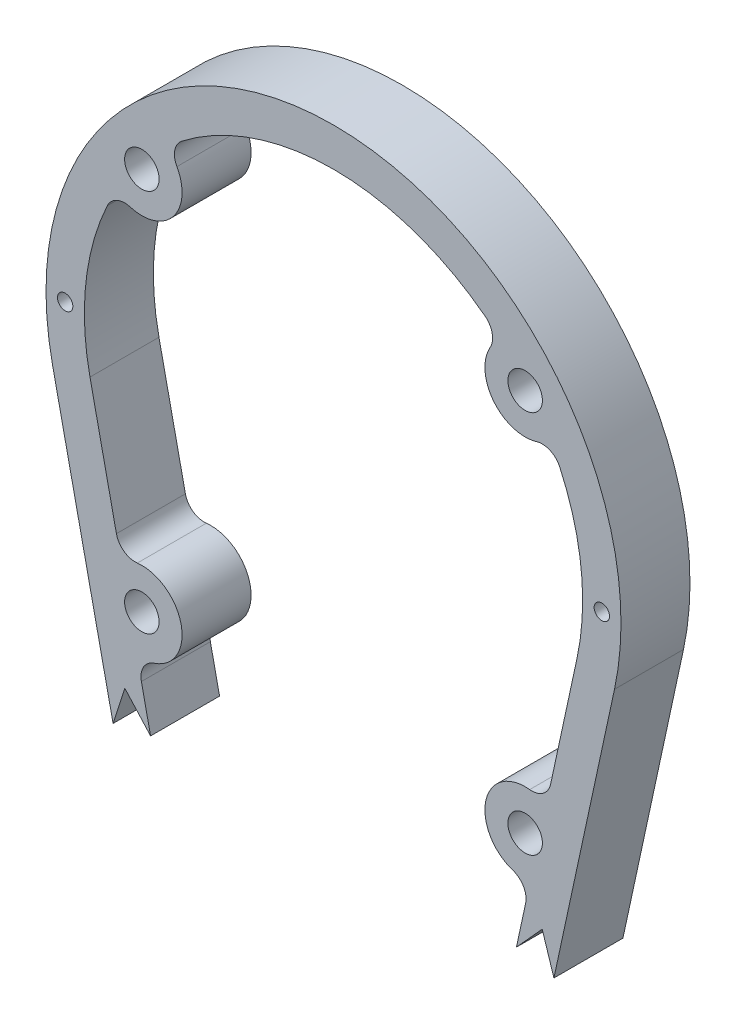
ISO-10303-21;
HEADER;
FILE_DESCRIPTION(('STEP AP214'),'2;1');
FILE_NAME('part.step','',(''),(''),'','','');
FILE_SCHEMA(('AUTOMOTIVE_DESIGN { 1 0 10303 214 1 1 1 1 }'));
ENDSEC;
DATA;
#1=APPLICATION_CONTEXT('core data for automotive mechanical design processes');
#2=APPLICATION_PROTOCOL_DEFINITION('international standard','automotive_design',2000,#1);
#3=PRODUCT_CONTEXT('',#1,'mechanical');
#4=PRODUCT('Part','Part','',(#3));
#5=PRODUCT_RELATED_PRODUCT_CATEGORY('part','',(#4));
#6=PRODUCT_DEFINITION_FORMATION('','',#4);
#7=PRODUCT_DEFINITION_CONTEXT('part definition',#1,'design');
#8=PRODUCT_DEFINITION('design','',#6,#7);
#9=PRODUCT_DEFINITION_SHAPE('','',#8);
#10=(LENGTH_UNIT() NAMED_UNIT(*) SI_UNIT(.MILLI.,.METRE.));
#11=(NAMED_UNIT(*) PLANE_ANGLE_UNIT() SI_UNIT($,.RADIAN.));
#12=(NAMED_UNIT(*) SI_UNIT($,.STERADIAN.) SOLID_ANGLE_UNIT());
#13=UNCERTAINTY_MEASURE_WITH_UNIT(LENGTH_MEASURE(1.E-05),#10,'distance_accuracy_value','');
#14=(GEOMETRIC_REPRESENTATION_CONTEXT(3) GLOBAL_UNCERTAINTY_ASSIGNED_CONTEXT((#13)) GLOBAL_UNIT_ASSIGNED_CONTEXT((#10,
#11,#12)) REPRESENTATION_CONTEXT('',''));
#15=CARTESIAN_POINT('',(0.,0.,0.));
#16=DIRECTION('',(0.,0.,1.));
#17=DIRECTION('',(1.,0.,0.));
#18=AXIS2_PLACEMENT_3D('',#15,#16,#17);
#19=CARTESIAN_POINT('',(-31.9298733487398,-112.5,18.));
#20=DIRECTION('',(0.,0.,1.));
#21=DIRECTION('',(1.,0.,0.));
#22=AXIS2_PLACEMENT_3D('',#19,#20,#21);
#23=PLANE('',#22);
#24=CARTESIAN_POINT('',(70.,47.5,18.));
#25=DIRECTION('',(0.,0.,1.));
#26=DIRECTION('',(1.,0.,0.));
#27=AXIS2_PLACEMENT_3D('',#24,#25,#26);
#28=CIRCLE('',#27,2.);
#29=CARTESIAN_POINT('',(72.,47.5,18.));
#30=VERTEX_POINT('',#29);
#31=EDGE_CURVE('E557',#30,#30,#28,.T.);
#32=ORIENTED_EDGE('',*,*,#31,.F.);
#33=EDGE_LOOP('',(#32));
#34=FACE_BOUND('',#33,.T.);
#35=CARTESIAN_POINT('',(-70.,47.5,18.));
#36=DIRECTION('',(0.,0.,1.));
#37=DIRECTION('',(1.,0.,0.));
#38=AXIS2_PLACEMENT_3D('',#35,#36,#37);
#39=CIRCLE('',#38,2.);
#40=CARTESIAN_POINT('',(-68.,47.5,18.));
#41=VERTEX_POINT('',#40);
#42=EDGE_CURVE('E551',#41,#41,#39,.T.);
#43=ORIENTED_EDGE('',*,*,#42,.F.);
#44=EDGE_LOOP('',(#43));
#45=FACE_BOUND('',#44,.T.);
#46=DIRECTION('',(-0.306753150837407,-0.95178910713,0.));
#47=VECTOR('',#46,1.);
#48=CARTESIAN_POINT('',(-57.5063561450649,-41.4755483598365,18.));
#49=LINE('',#48,#47);
#50=CARTESIAN_POINT('',(-54.4439824625953,-31.9736609139237,18.));
#51=VERTEX_POINT('',#50);
#52=CARTESIAN_POINT('',(-57.5063561450649,-41.4755483598365,18.));
#53=VERTEX_POINT('',#52);
#54=EDGE_CURVE('E217',#51,#53,#49,.T.);
#55=ORIENTED_EDGE('',*,*,#54,.F.);
#56=DIRECTION('',(-0.67089697040122,0.741550574881083,0.));
#57=VECTOR('',#56,1.);
#58=CARTESIAN_POINT('',(-54.4439824625953,-31.9736609139237,18.));
#59=LINE('',#58,#57);
#60=CARTESIAN_POINT('',(-47.7236876934698,-39.4016843948391,18.));
#61=VERTEX_POINT('',#60);
#62=EDGE_CURVE('E542',#61,#51,#59,.T.);
#63=ORIENTED_EDGE('',*,*,#62,.F.);
#64=DIRECTION('',(0.211189373172623,-0.977445164016353,0.));
#65=VECTOR('',#64,1.);
#66=CARTESIAN_POINT('',(-31.9298733487398,-112.5,18.));
#67=LINE('',#66,#65);
#68=CARTESIAN_POINT('',(-50.1212592306133,-28.3050337009208,18.));
#69=VERTEX_POINT('',#68);
#70=EDGE_CURVE('E363',#69,#61,#67,.T.);
#71=ORIENTED_EDGE('',*,*,#70,.F.);
#72=CARTESIAN_POINT('',(-45.2340334105316,-27.2490868350576,18.));
#73=DIRECTION('',(0.,0.,1.));
#74=DIRECTION('',(1.,0.,0.));
#75=AXIS2_PLACEMENT_3D('',#72,#73,#74);
#76=CIRCLE('',#75,5.);
#77=CARTESIAN_POINT('',(-46.7714419877795,-22.4913168882649,18.));
#78=VERTEX_POINT('',#77);
#79=EDGE_CURVE('E305',#69,#78,#76,.F.);
#80=ORIENTED_EDGE('',*,*,#79,.T.);
#81=CARTESIAN_POINT('',(-50.,-12.5,18.));
#82=DIRECTION('',(0.,0.,-1.));
#83=DIRECTION('',(1.,0.,0.));
#84=AXIS2_PLACEMENT_3D('',#81,#82,#83);
#85=CIRCLE('',#84,10.5);
#86=CARTESIAN_POINT('',(-51.1843712947804,-2.06701075261266,18.));
#87=VERTEX_POINT('',#86);
#88=EDGE_CURVE('E360',#87,#78,#85,.T.);
#89=ORIENTED_EDGE('',*,*,#88,.F.);
#90=CARTESIAN_POINT('',(-51.7483576256283,2.90107936519085,18.));
#91=DIRECTION('',(0.,0.,1.));
#92=DIRECTION('',(1.,0.,0.));
#93=AXIS2_PLACEMENT_3D('',#90,#91,#92);
#94=CIRCLE('',#93,5.);
#95=CARTESIAN_POINT('',(-56.63558344571,1.84513249932773,18.));
#96=VERTEX_POINT('',#95);
#97=EDGE_CURVE('E292',#87,#96,#94,.F.);
#98=ORIENTED_EDGE('',*,*,#97,.T.);
#99=DIRECTION('',(0.211189373172623,-0.977445164016353,0.));
#100=VECTOR('',#99,1.);
#101=CARTESIAN_POINT('',(-55.4723236772757,-3.53876830055558,18.));
#102=LINE('',#101,#100);
#103=CARTESIAN_POINT('',(-63.5339356610629,33.7726907437795,18.));
#104=VERTEX_POINT('',#103);
#105=EDGE_CURVE('E351',#104,#96,#102,.T.);
#106=ORIENTED_EDGE('',*,*,#105,.F.);
#107=CARTESIAN_POINT('',(0.,47.5,18.));
#108=DIRECTION('',(0.,0.,1.));
#109=DIRECTION('',(1.,0.,0.));
#110=AXIS2_PLACEMENT_3D('',#107,#108,#109);
#111=CIRCLE('',#110,65.);
#112=CARTESIAN_POINT('',(-59.0097536999229,74.755255791763,18.));
#113=VERTEX_POINT('',#112);
#114=EDGE_CURVE('E345',#113,#104,#111,.T.);
#115=ORIENTED_EDGE('',*,*,#114,.F.);
#116=CARTESIAN_POINT('',(-54.4705418768519,72.6586976539351,18.));
#117=DIRECTION('',(0.,0.,1.));
#118=DIRECTION('',(1.,0.,0.));
#119=AXIS2_PLACEMENT_3D('',#116,#117,#118);
#120=CIRCLE('',#119,5.);
#121=CARTESIAN_POINT('',(-53.0284315939965,77.4462145397625,18.));
#122=VERTEX_POINT('',#121);
#123=EDGE_CURVE('E11',#113,#122,#120,.F.);
#124=ORIENTED_EDGE('',*,*,#123,.T.);
#125=CARTESIAN_POINT('',(-50.,87.5,18.));
#126=DIRECTION('',(0.,0.,-1.));
#127=DIRECTION('',(1.,0.,0.));
#128=AXIS2_PLACEMENT_3D('',#125,#126,#127);
#129=CIRCLE('',#128,10.5);
#130=CARTESIAN_POINT('',(-40.8562064862553,92.661495924439,18.));
#131=VERTEX_POINT('',#130);
#132=EDGE_CURVE('E342',#131,#122,#129,.T.);
#133=ORIENTED_EDGE('',*,*,#132,.F.);
#134=CARTESIAN_POINT('',(-36.5020190987578,95.1193511265528,18.));
#135=DIRECTION('',(0.,0.,1.));
#136=DIRECTION('',(1.,0.,0.));
#137=AXIS2_PLACEMENT_3D('',#134,#135,#136);
#138=CIRCLE('',#137,5.);
#139=CARTESIAN_POINT('',(-39.5438540236543,99.0876303870988,18.));
#140=VERTEX_POINT('',#139);
#141=EDGE_CURVE('E317',#131,#140,#138,.F.);
#142=ORIENTED_EDGE('',*,*,#141,.T.);
#143=CARTESIAN_POINT('',(0.,47.5,18.));
#144=DIRECTION('',(0.,0.,1.));
#145=DIRECTION('',(1.,0.,0.));
#146=AXIS2_PLACEMENT_3D('',#143,#144,#145);
#147=CIRCLE('',#146,65.);
#148=CARTESIAN_POINT('',(39.5438540236543,99.0876303870988,18.));
#149=VERTEX_POINT('',#148);
#150=EDGE_CURVE('E349',#149,#140,#147,.T.);
#151=ORIENTED_EDGE('',*,*,#150,.F.);
#152=CARTESIAN_POINT('',(36.5020190987578,95.1193511265527,18.));
#153=DIRECTION('',(0.,0.,1.));
#154=DIRECTION('',(1.,0.,0.));
#155=AXIS2_PLACEMENT_3D('',#152,#153,#154);
#156=CIRCLE('',#155,5.);
#157=CARTESIAN_POINT('',(40.8562064862553,92.6614959244389,18.));
#158=VERTEX_POINT('',#157);
#159=EDGE_CURVE('E313',#149,#158,#156,.F.);
#160=ORIENTED_EDGE('',*,*,#159,.T.);
#161=CARTESIAN_POINT('',(50.,87.5,18.));
#162=DIRECTION('',(0.,0.,-1.));
#163=DIRECTION('',(1.,0.,0.));
#164=AXIS2_PLACEMENT_3D('',#161,#162,#163);
#165=CIRCLE('',#164,10.5);
#166=CARTESIAN_POINT('',(53.0284315939965,77.4462145397625,18.));
#167=VERTEX_POINT('',#166);
#168=EDGE_CURVE('E354',#167,#158,#165,.T.);
#169=ORIENTED_EDGE('',*,*,#168,.F.);
#170=CARTESIAN_POINT('',(54.470541876852,72.6586976539351,18.));
#171=DIRECTION('',(0.,0.,1.));
#172=DIRECTION('',(1.,0.,0.));
#173=AXIS2_PLACEMENT_3D('',#170,#171,#172);
#174=CIRCLE('',#173,5.);
#175=CARTESIAN_POINT('',(59.009753699923,74.755255791763,18.));
#176=VERTEX_POINT('',#175);
#177=EDGE_CURVE('E309',#167,#176,#174,.F.);
#178=ORIENTED_EDGE('',*,*,#177,.T.);
#179=CARTESIAN_POINT('',(0.,47.5,18.));
#180=DIRECTION('',(0.,0.,1.));
#181=DIRECTION('',(1.,0.,0.));
#182=AXIS2_PLACEMENT_3D('',#179,#180,#181);
#183=CIRCLE('',#182,65.);
#184=CARTESIAN_POINT('',(63.5339356610629,33.7726907437795,18.));
#185=VERTEX_POINT('',#184);
#186=EDGE_CURVE('E445',#185,#176,#183,.T.);
#187=ORIENTED_EDGE('',*,*,#186,.F.);
#188=DIRECTION('',(0.211189373172623,0.977445164016353,0.));
#189=VECTOR('',#188,1.);
#190=CARTESIAN_POINT('',(55.4723236772757,-3.53876830055554,18.));
#191=LINE('',#190,#189);
#192=CARTESIAN_POINT('',(56.63558344571,1.84513249932773,18.));
#193=VERTEX_POINT('',#192);
#194=EDGE_CURVE('E443',#193,#185,#191,.T.);
#195=ORIENTED_EDGE('',*,*,#194,.F.);
#196=CARTESIAN_POINT('',(51.7483576256282,2.90107936519085,18.));
#197=DIRECTION('',(0.,0.,1.));
#198=DIRECTION('',(1.,0.,0.));
#199=AXIS2_PLACEMENT_3D('',#196,#197,#198);
#200=CIRCLE('',#199,5.);
#201=CARTESIAN_POINT('',(51.1843712947804,-2.06701075261265,18.));
#202=VERTEX_POINT('',#201);
#203=EDGE_CURVE('E296',#193,#202,#200,.F.);
#204=ORIENTED_EDGE('',*,*,#203,.T.);
#205=CARTESIAN_POINT('',(50.,-12.5,18.));
#206=DIRECTION('',(0.,0.,-1.));
#207=DIRECTION('',(1.,0.,0.));
#208=AXIS2_PLACEMENT_3D('',#205,#206,#207);
#209=CIRCLE('',#208,10.5);
#210=CARTESIAN_POINT('',(46.7714419877795,-22.4913168882648,18.));
#211=VERTEX_POINT('',#210);
#212=EDGE_CURVE('E393',#211,#202,#209,.T.);
#213=ORIENTED_EDGE('',*,*,#212,.F.);
#214=CARTESIAN_POINT('',(45.2340334105316,-27.2490868350576,18.));
#215=DIRECTION('',(0.,0.,1.));
#216=DIRECTION('',(1.,0.,0.));
#217=AXIS2_PLACEMENT_3D('',#214,#215,#216);
#218=CIRCLE('',#217,5.);
#219=CARTESIAN_POINT('',(50.1212592306133,-28.3050337009207,18.));
#220=VERTEX_POINT('',#219);
#221=EDGE_CURVE('E300',#211,#220,#218,.F.);
#222=ORIENTED_EDGE('',*,*,#221,.T.);
#223=DIRECTION('',(0.211189373172623,0.977445164016353,0.));
#224=VECTOR('',#223,1.);
#225=CARTESIAN_POINT('',(31.9298733487398,-112.5,18.));
#226=LINE('',#225,#224);
#227=CARTESIAN_POINT('',(47.7244032118376,-39.3983727700264,18.));
#228=VERTEX_POINT('',#227);
#229=EDGE_CURVE('E366',#228,#220,#226,.T.);
#230=ORIENTED_EDGE('',*,*,#229,.F.);
#231=DIRECTION('',(-0.670959777554308,-0.741493747043273,0.));
#232=VECTOR('',#231,1.);
#233=CARTESIAN_POINT('',(47.7244032118376,-39.3983727700264,18.));
#234=LINE('',#233,#232);
#235=CARTESIAN_POINT('',(54.4443390688109,-31.9720104377862,18.));
#236=VERTEX_POINT('',#235);
#237=EDGE_CURVE('E57',#236,#228,#234,.T.);
#238=ORIENTED_EDGE('',*,*,#237,.F.);
#239=DIRECTION('',(-0.306672532909785,0.951815085801174,0.));
#240=VECTOR('',#239,1.);
#241=CARTESIAN_POINT('',(54.4443390688109,-31.9720104377862,18.));
#242=LINE('',#241,#240);
#243=CARTESIAN_POINT('',(57.5063561450649,-41.4755483598365,18.));
#244=VERTEX_POINT('',#243);
#245=EDGE_CURVE('E541',#244,#236,#242,.T.);
#246=ORIENTED_EDGE('',*,*,#245,.F.);
#247=DIRECTION('',(0.211189373172623,0.977445164016353,0.));
#248=VECTOR('',#247,1.);
#249=CARTESIAN_POINT('',(41.7043249889033,-114.611893731726,18.));
#250=LINE('',#249,#248);
#251=CARTESIAN_POINT('',(73.3083873012265,31.6607970120533,18.));
#252=VERTEX_POINT('',#251);
#253=EDGE_CURVE('E225',#244,#252,#250,.T.);
#254=ORIENTED_EDGE('',*,*,#253,.T.);
#255=CARTESIAN_POINT('',(0.,47.5,18.));
#256=DIRECTION('',(0.,0.,1.));
#257=DIRECTION('',(1.,0.,0.));
#258=AXIS2_PLACEMENT_3D('',#255,#256,#257);
#259=CIRCLE('',#258,75.);
#260=CARTESIAN_POINT('',(-73.3083873012264,31.6607970120533,18.));
#261=VERTEX_POINT('',#260);
#262=EDGE_CURVE('E418',#252,#261,#259,.T.);
#263=ORIENTED_EDGE('',*,*,#262,.T.);
#264=DIRECTION('',(0.211189373172623,-0.977445164016353,0.));
#265=VECTOR('',#264,1.);
#266=CARTESIAN_POINT('',(-73.3083873012264,31.6607970120533,18.));
#267=LINE('',#266,#265);
#268=EDGE_CURVE('E240',#261,#53,#267,.T.);
#269=ORIENTED_EDGE('',*,*,#268,.T.);
#270=EDGE_LOOP('',(#55,#63,#71,#80,#89,#98,#106,#115,#124,#133,#142,#151,#160,#169,#178,#187,
#195,#204,#213,#222,#230,#238,#246,#254,#263,#269));
#271=FACE_BOUND('',#270,.T.);
#272=CARTESIAN_POINT('',(-50.,87.5,18.));
#273=DIRECTION('',(0.,0.,1.));
#274=DIRECTION('',(1.,0.,0.));
#275=AXIS2_PLACEMENT_3D('',#272,#273,#274);
#276=CIRCLE('',#275,4.5);
#277=CARTESIAN_POINT('',(-45.5,87.5,18.));
#278=VERTEX_POINT('',#277);
#279=EDGE_CURVE('E405',#278,#278,#276,.T.);
#280=ORIENTED_EDGE('',*,*,#279,.F.);
#281=EDGE_LOOP('',(#280));
#282=FACE_BOUND('',#281,.T.);
#283=CARTESIAN_POINT('',(50.,-12.5,18.));
#284=DIRECTION('',(0.,0.,1.));
#285=DIRECTION('',(1.,0.,0.));
#286=AXIS2_PLACEMENT_3D('',#283,#284,#285);
#287=CIRCLE('',#286,4.5);
#288=CARTESIAN_POINT('',(54.5,-12.5,18.));
#289=VERTEX_POINT('',#288);
#290=EDGE_CURVE('E232',#289,#289,#287,.T.);
#291=ORIENTED_EDGE('',*,*,#290,.F.);
#292=EDGE_LOOP('',(#291));
#293=FACE_BOUND('',#292,.T.);
#294=CARTESIAN_POINT('',(50.,87.5,18.));
#295=DIRECTION('',(0.,0.,1.));
#296=DIRECTION('',(1.,0.,0.));
#297=AXIS2_PLACEMENT_3D('',#294,#295,#296);
#298=CIRCLE('',#297,4.5);
#299=CARTESIAN_POINT('',(54.5,87.5,18.));
#300=VERTEX_POINT('',#299);
#301=EDGE_CURVE('E411',#300,#300,#298,.T.);
#302=ORIENTED_EDGE('',*,*,#301,.F.);
#303=EDGE_LOOP('',(#302));
#304=FACE_BOUND('',#303,.T.);
#305=CARTESIAN_POINT('',(-50.,-12.5,18.));
#306=DIRECTION('',(0.,0.,1.));
#307=DIRECTION('',(1.,0.,0.));
#308=AXIS2_PLACEMENT_3D('',#305,#306,#307);
#309=CIRCLE('',#308,4.5);
#310=CARTESIAN_POINT('',(-45.5,-12.5,18.));
#311=VERTEX_POINT('',#310);
#312=EDGE_CURVE('E399',#311,#311,#309,.T.);
#313=ORIENTED_EDGE('',*,*,#312,.F.);
#314=EDGE_LOOP('',(#313));
#315=FACE_BOUND('',#314,.T.);
#316=ADVANCED_FACE('F34',(#34,#45,#271,#282,#293,#304,#315),#23,.T.);
#317=CARTESIAN_POINT('',(-31.9298733487398,-112.5,0.));
#318=DIRECTION('',(0.,0.,1.));
#319=DIRECTION('',(1.,0.,0.));
#320=AXIS2_PLACEMENT_3D('',#317,#318,#319);
#321=PLANE('',#320);
#322=CARTESIAN_POINT('',(70.,47.5,0.));
#323=DIRECTION('',(0.,0.,1.));
#324=DIRECTION('',(1.,0.,0.));
#325=AXIS2_PLACEMENT_3D('',#322,#323,#324);
#326=CIRCLE('',#325,2.);
#327=CARTESIAN_POINT('',(72.,47.5,0.));
#328=VERTEX_POINT('',#327);
#329=EDGE_CURVE('E554',#328,#328,#326,.T.);
#330=ORIENTED_EDGE('',*,*,#329,.T.);
#331=EDGE_LOOP('',(#330));
#332=FACE_BOUND('',#331,.T.);
#333=CARTESIAN_POINT('',(-70.,47.5,0.));
#334=DIRECTION('',(0.,0.,1.));
#335=DIRECTION('',(1.,0.,0.));
#336=AXIS2_PLACEMENT_3D('',#333,#334,#335);
#337=CIRCLE('',#336,2.);
#338=CARTESIAN_POINT('',(-68.,47.5,0.));
#339=VERTEX_POINT('',#338);
#340=EDGE_CURVE('E545',#339,#339,#337,.T.);
#341=ORIENTED_EDGE('',*,*,#340,.T.);
#342=EDGE_LOOP('',(#341));
#343=FACE_BOUND('',#342,.T.);
#344=CARTESIAN_POINT('',(-50.,-12.5,0.));
#345=DIRECTION('',(0.,0.,1.));
#346=DIRECTION('',(1.,0.,0.));
#347=AXIS2_PLACEMENT_3D('',#344,#345,#346);
#348=CIRCLE('',#347,4.5);
#349=CARTESIAN_POINT('',(-45.5,-12.5,0.));
#350=VERTEX_POINT('',#349);
#351=EDGE_CURVE('E398',#350,#350,#348,.T.);
#352=ORIENTED_EDGE('',*,*,#351,.T.);
#353=EDGE_LOOP('',(#352));
#354=FACE_BOUND('',#353,.T.);
#355=CARTESIAN_POINT('',(-50.,87.5,0.));
#356=DIRECTION('',(0.,0.,1.));
#357=DIRECTION('',(1.,0.,0.));
#358=AXIS2_PLACEMENT_3D('',#355,#356,#357);
#359=CIRCLE('',#358,4.5);
#360=CARTESIAN_POINT('',(-45.5,87.5,0.));
#361=VERTEX_POINT('',#360);
#362=EDGE_CURVE('E402',#361,#361,#359,.T.);
#363=ORIENTED_EDGE('',*,*,#362,.T.);
#364=EDGE_LOOP('',(#363));
#365=FACE_BOUND('',#364,.T.);
#366=CARTESIAN_POINT('',(50.,87.5,0.));
#367=DIRECTION('',(0.,0.,1.));
#368=DIRECTION('',(1.,0.,0.));
#369=AXIS2_PLACEMENT_3D('',#366,#367,#368);
#370=CIRCLE('',#369,4.5);
#371=CARTESIAN_POINT('',(54.5,87.5,0.));
#372=VERTEX_POINT('',#371);
#373=EDGE_CURVE('E408',#372,#372,#370,.T.);
#374=ORIENTED_EDGE('',*,*,#373,.T.);
#375=EDGE_LOOP('',(#374));
#376=FACE_BOUND('',#375,.T.);
#377=CARTESIAN_POINT('',(50.,-12.5,0.));
#378=DIRECTION('',(0.,0.,1.));
#379=DIRECTION('',(1.,0.,0.));
#380=AXIS2_PLACEMENT_3D('',#377,#378,#379);
#381=CIRCLE('',#380,4.5);
#382=CARTESIAN_POINT('',(54.5,-12.5,0.));
#383=VERTEX_POINT('',#382);
#384=EDGE_CURVE('E237',#383,#383,#381,.T.);
#385=ORIENTED_EDGE('',*,*,#384,.T.);
#386=EDGE_LOOP('',(#385));
#387=FACE_BOUND('',#386,.T.);
#388=DIRECTION('',(-0.67089697040122,0.741550574881083,0.));
#389=VECTOR('',#388,1.);
#390=CARTESIAN_POINT('',(-54.4439824625953,-31.9736609139237,0.));
#391=LINE('',#390,#389);
#392=CARTESIAN_POINT('',(-47.7236876934698,-39.4016843948391,0.));
#393=VERTEX_POINT('',#392);
#394=CARTESIAN_POINT('',(-54.4439824625953,-31.9736609139237,0.));
#395=VERTEX_POINT('',#394);
#396=EDGE_CURVE('E49',#393,#395,#391,.T.);
#397=ORIENTED_EDGE('',*,*,#396,.T.);
#398=DIRECTION('',(-0.306753150837407,-0.95178910713,0.));
#399=VECTOR('',#398,1.);
#400=CARTESIAN_POINT('',(-57.5063561450649,-41.4755483598365,0.));
#401=LINE('',#400,#399);
#402=CARTESIAN_POINT('',(-57.5063561450649,-41.4755483598365,0.));
#403=VERTEX_POINT('',#402);
#404=EDGE_CURVE('E226',#395,#403,#401,.T.);
#405=ORIENTED_EDGE('',*,*,#404,.T.);
#406=DIRECTION('',(0.211189373172623,-0.977445164016353,0.));
#407=VECTOR('',#406,1.);
#408=CARTESIAN_POINT('',(-73.3083873012264,31.6607970120533,0.));
#409=LINE('',#408,#407);
#410=CARTESIAN_POINT('',(-73.3083873012264,31.6607970120533,0.));
#411=VERTEX_POINT('',#410);
#412=EDGE_CURVE('E234',#411,#403,#409,.T.);
#413=ORIENTED_EDGE('',*,*,#412,.F.);
#414=CARTESIAN_POINT('',(0.,47.5,0.));
#415=DIRECTION('',(0.,0.,1.));
#416=DIRECTION('',(1.,0.,0.));
#417=AXIS2_PLACEMENT_3D('',#414,#415,#416);
#418=CIRCLE('',#417,75.);
#419=CARTESIAN_POINT('',(73.3083873012265,31.6607970120533,0.));
#420=VERTEX_POINT('',#419);
#421=EDGE_CURVE('E231',#420,#411,#418,.T.);
#422=ORIENTED_EDGE('',*,*,#421,.F.);
#423=DIRECTION('',(0.211189373172623,0.977445164016353,0.));
#424=VECTOR('',#423,1.);
#425=CARTESIAN_POINT('',(41.7043249889033,-114.611893731726,0.));
#426=LINE('',#425,#424);
#427=CARTESIAN_POINT('',(57.5063561450649,-41.4755483598365,0.));
#428=VERTEX_POINT('',#427);
#429=EDGE_CURVE('E223',#428,#420,#426,.T.);
#430=ORIENTED_EDGE('',*,*,#429,.F.);
#431=DIRECTION('',(-0.306672532909785,0.951815085801174,0.));
#432=VECTOR('',#431,1.);
#433=CARTESIAN_POINT('',(54.4443390688109,-31.9720104377862,0.));
#434=LINE('',#433,#432);
#435=CARTESIAN_POINT('',(54.4443390688109,-31.9720104377862,0.));
#436=VERTEX_POINT('',#435);
#437=EDGE_CURVE('E205',#428,#436,#434,.T.);
#438=ORIENTED_EDGE('',*,*,#437,.T.);
#439=DIRECTION('',(-0.670959777554308,-0.741493747043273,0.));
#440=VECTOR('',#439,1.);
#441=CARTESIAN_POINT('',(47.7244032118376,-39.3983727700264,0.));
#442=LINE('',#441,#440);
#443=CARTESIAN_POINT('',(47.7244032118376,-39.3983727700264,0.));
#444=VERTEX_POINT('',#443);
#445=EDGE_CURVE('E216',#436,#444,#442,.T.);
#446=ORIENTED_EDGE('',*,*,#445,.T.);
#447=DIRECTION('',(0.211189373172623,0.977445164016353,0.));
#448=VECTOR('',#447,1.);
#449=CARTESIAN_POINT('',(31.9298733487398,-112.5,0.));
#450=LINE('',#449,#448);
#451=CARTESIAN_POINT('',(50.1212592306133,-28.3050337009207,0.));
#452=VERTEX_POINT('',#451);
#453=EDGE_CURVE('E391',#444,#452,#450,.T.);
#454=ORIENTED_EDGE('',*,*,#453,.T.);
#455=CARTESIAN_POINT('',(45.2340334105316,-27.2490868350576,0.));
#456=DIRECTION('',(0.,0.,1.));
#457=DIRECTION('',(1.,0.,0.));
#458=AXIS2_PLACEMENT_3D('',#455,#456,#457);
#459=CIRCLE('',#458,5.);
#460=CARTESIAN_POINT('',(46.7714419877795,-22.4913168882648,0.));
#461=VERTEX_POINT('',#460);
#462=EDGE_CURVE('E298',#452,#461,#459,.T.);
#463=ORIENTED_EDGE('',*,*,#462,.T.);
#464=CARTESIAN_POINT('',(50.,-12.5,0.));
#465=DIRECTION('',(0.,0.,-1.));
#466=DIRECTION('',(1.,0.,0.));
#467=AXIS2_PLACEMENT_3D('',#464,#465,#466);
#468=CIRCLE('',#467,10.5);
#469=CARTESIAN_POINT('',(51.1843712947804,-2.06701075261265,0.));
#470=VERTEX_POINT('',#469);
#471=EDGE_CURVE('E368',#461,#470,#468,.T.);
#472=ORIENTED_EDGE('',*,*,#471,.T.);
#473=CARTESIAN_POINT('',(51.7483576256282,2.90107936519085,0.));
#474=DIRECTION('',(0.,0.,1.));
#475=DIRECTION('',(1.,0.,0.));
#476=AXIS2_PLACEMENT_3D('',#473,#474,#475);
#477=CIRCLE('',#476,5.);
#478=CARTESIAN_POINT('',(56.63558344571,1.84513249932773,0.));
#479=VERTEX_POINT('',#478);
#480=EDGE_CURVE('E294',#470,#479,#477,.T.);
#481=ORIENTED_EDGE('',*,*,#480,.T.);
#482=DIRECTION('',(0.211189373172623,0.977445164016353,0.));
#483=VECTOR('',#482,1.);
#484=CARTESIAN_POINT('',(55.4723236772757,-3.53876830055554,0.));
#485=LINE('',#484,#483);
#486=CARTESIAN_POINT('',(63.5339356610629,33.7726907437795,0.));
#487=VERTEX_POINT('',#486);
#488=EDGE_CURVE('E371',#479,#487,#485,.T.);
#489=ORIENTED_EDGE('',*,*,#488,.T.);
#490=CARTESIAN_POINT('',(0.,47.5,0.));
#491=DIRECTION('',(0.,0.,1.));
#492=DIRECTION('',(1.,0.,0.));
#493=AXIS2_PLACEMENT_3D('',#490,#491,#492);
#494=CIRCLE('',#493,65.);
#495=CARTESIAN_POINT('',(59.009753699923,74.755255791763,0.));
#496=VERTEX_POINT('',#495);
#497=EDGE_CURVE('E374',#487,#496,#494,.T.);
#498=ORIENTED_EDGE('',*,*,#497,.T.);
#499=CARTESIAN_POINT('',(54.470541876852,72.6586976539351,0.));
#500=DIRECTION('',(0.,0.,1.));
#501=DIRECTION('',(1.,0.,0.));
#502=AXIS2_PLACEMENT_3D('',#499,#500,#501);
#503=CIRCLE('',#502,5.);
#504=CARTESIAN_POINT('',(53.0284315939965,77.4462145397625,0.));
#505=VERTEX_POINT('',#504);
#506=EDGE_CURVE('E307',#496,#505,#503,.T.);
#507=ORIENTED_EDGE('',*,*,#506,.T.);
#508=CARTESIAN_POINT('',(50.,87.5,0.));
#509=DIRECTION('',(0.,0.,-1.));
#510=DIRECTION('',(1.,0.,0.));
#511=AXIS2_PLACEMENT_3D('',#508,#509,#510);
#512=CIRCLE('',#511,10.5);
#513=CARTESIAN_POINT('',(40.8562064862553,92.6614959244389,0.));
#514=VERTEX_POINT('',#513);
#515=EDGE_CURVE('E377',#505,#514,#512,.T.);
#516=ORIENTED_EDGE('',*,*,#515,.T.);
#517=CARTESIAN_POINT('',(36.5020190987578,95.1193511265527,0.));
#518=DIRECTION('',(0.,0.,1.));
#519=DIRECTION('',(1.,0.,0.));
#520=AXIS2_PLACEMENT_3D('',#517,#518,#519);
#521=CIRCLE('',#520,5.);
#522=CARTESIAN_POINT('',(39.5438540236543,99.0876303870988,0.));
#523=VERTEX_POINT('',#522);
#524=EDGE_CURVE('E311',#514,#523,#521,.T.);
#525=ORIENTED_EDGE('',*,*,#524,.T.);
#526=CARTESIAN_POINT('',(0.,47.5,0.));
#527=DIRECTION('',(0.,0.,1.));
#528=DIRECTION('',(1.,0.,0.));
#529=AXIS2_PLACEMENT_3D('',#526,#527,#528);
#530=CIRCLE('',#529,65.);
#531=CARTESIAN_POINT('',(-39.5438540236543,99.0876303870988,0.));
#532=VERTEX_POINT('',#531);
#533=EDGE_CURVE('E380',#523,#532,#530,.T.);
#534=ORIENTED_EDGE('',*,*,#533,.T.);
#535=CARTESIAN_POINT('',(-36.5020190987578,95.1193511265528,0.));
#536=DIRECTION('',(0.,0.,1.));
#537=DIRECTION('',(1.,0.,0.));
#538=AXIS2_PLACEMENT_3D('',#535,#536,#537);
#539=CIRCLE('',#538,5.);
#540=CARTESIAN_POINT('',(-40.8562064862553,92.661495924439,0.));
#541=VERTEX_POINT('',#540);
#542=EDGE_CURVE('E315',#532,#541,#539,.T.);
#543=ORIENTED_EDGE('',*,*,#542,.T.);
#544=CARTESIAN_POINT('',(-50.,87.5,0.));
#545=DIRECTION('',(0.,0.,-1.));
#546=DIRECTION('',(1.,0.,0.));
#547=AXIS2_PLACEMENT_3D('',#544,#545,#546);
#548=CIRCLE('',#547,10.5);
#549=CARTESIAN_POINT('',(-53.0284315939965,77.4462145397625,0.));
#550=VERTEX_POINT('',#549);
#551=EDGE_CURVE('E324',#541,#550,#548,.T.);
#552=ORIENTED_EDGE('',*,*,#551,.T.);
#553=CARTESIAN_POINT('',(-54.4705418768519,72.6586976539351,0.));
#554=DIRECTION('',(0.,0.,1.));
#555=DIRECTION('',(1.,0.,0.));
#556=AXIS2_PLACEMENT_3D('',#553,#554,#555);
#557=CIRCLE('',#556,5.);
#558=CARTESIAN_POINT('',(-59.0097536999229,74.755255791763,0.));
#559=VERTEX_POINT('',#558);
#560=EDGE_CURVE('E42',#550,#559,#557,.T.);
#561=ORIENTED_EDGE('',*,*,#560,.T.);
#562=CARTESIAN_POINT('',(0.,47.5,0.));
#563=DIRECTION('',(0.,0.,1.));
#564=DIRECTION('',(1.,0.,0.));
#565=AXIS2_PLACEMENT_3D('',#562,#563,#564);
#566=CIRCLE('',#565,65.);
#567=CARTESIAN_POINT('',(-63.5339356610629,33.7726907437795,0.));
#568=VERTEX_POINT('',#567);
#569=EDGE_CURVE('E321',#559,#568,#566,.T.);
#570=ORIENTED_EDGE('',*,*,#569,.T.);
#571=DIRECTION('',(0.211189373172623,-0.977445164016353,0.));
#572=VECTOR('',#571,1.);
#573=CARTESIAN_POINT('',(-55.4723236772757,-3.53876830055558,0.));
#574=LINE('',#573,#572);
#575=CARTESIAN_POINT('',(-56.63558344571,1.84513249932773,0.));
#576=VERTEX_POINT('',#575);
#577=EDGE_CURVE('E334',#568,#576,#574,.T.);
#578=ORIENTED_EDGE('',*,*,#577,.T.);
#579=CARTESIAN_POINT('',(-51.7483576256283,2.90107936519085,0.));
#580=DIRECTION('',(0.,0.,1.));
#581=DIRECTION('',(1.,0.,0.));
#582=AXIS2_PLACEMENT_3D('',#579,#580,#581);
#583=CIRCLE('',#582,5.);
#584=CARTESIAN_POINT('',(-51.1843712947804,-2.06701075261266,0.));
#585=VERTEX_POINT('',#584);
#586=EDGE_CURVE('E290',#576,#585,#583,.T.);
#587=ORIENTED_EDGE('',*,*,#586,.T.);
#588=CARTESIAN_POINT('',(-50.,-12.5,0.));
#589=DIRECTION('',(0.,0.,-1.));
#590=DIRECTION('',(1.,0.,0.));
#591=AXIS2_PLACEMENT_3D('',#588,#589,#590);
#592=CIRCLE('',#591,10.5);
#593=CARTESIAN_POINT('',(-46.7714419877795,-22.4913168882649,0.));
#594=VERTEX_POINT('',#593);
#595=EDGE_CURVE('E385',#585,#594,#592,.T.);
#596=ORIENTED_EDGE('',*,*,#595,.T.);
#597=CARTESIAN_POINT('',(-45.2340334105316,-27.2490868350576,0.));
#598=DIRECTION('',(0.,0.,1.));
#599=DIRECTION('',(1.,0.,0.));
#600=AXIS2_PLACEMENT_3D('',#597,#598,#599);
#601=CIRCLE('',#600,5.);
#602=CARTESIAN_POINT('',(-50.1212592306133,-28.3050337009208,0.));
#603=VERTEX_POINT('',#602);
#604=EDGE_CURVE('E303',#594,#603,#601,.T.);
#605=ORIENTED_EDGE('',*,*,#604,.T.);
#606=DIRECTION('',(0.211189373172623,-0.977445164016353,0.));
#607=VECTOR('',#606,1.);
#608=CARTESIAN_POINT('',(-31.9298733487398,-112.5,0.));
#609=LINE('',#608,#607);
#610=EDGE_CURVE('E388',#603,#393,#609,.T.);
#611=ORIENTED_EDGE('',*,*,#610,.T.);
#612=EDGE_LOOP('',(#397,#405,#413,#422,#430,#438,#446,#454,#463,#472,#481,#489,#498,#507,#516,
#525,#534,#543,#552,#561,#570,#578,#587,#596,#605,#611));
#613=FACE_BOUND('',#612,.T.);
#614=ADVANCED_FACE('F229',(#332,#343,#354,#365,#376,#387,#613),#321,.F.);
#615=CARTESIAN_POINT('',(41.7043249889033,-114.611893731726,18.));
#616=DIRECTION('',(-0.977445164016353,0.211189373172623,0.));
#617=DIRECTION('',(-0.211189373172623,-0.977445164016353,0.));
#618=AXIS2_PLACEMENT_3D('',#615,#616,#617);
#619=PLANE('',#618);
#620=ORIENTED_EDGE('',*,*,#253,.F.);
#621=DIRECTION('',(0.,0.,1.));
#622=VECTOR('',#621,1.);
#623=CARTESIAN_POINT('',(57.5063561450649,-41.4755483598365,0.));
#624=LINE('',#623,#622);
#625=EDGE_CURVE('E209',#428,#244,#624,.T.);
#626=ORIENTED_EDGE('',*,*,#625,.F.);
#627=ORIENTED_EDGE('',*,*,#429,.T.);
#628=DIRECTION('',(0.,0.,-1.));
#629=VECTOR('',#628,1.);
#630=CARTESIAN_POINT('',(73.3083873012265,31.6607970120533,18.));
#631=LINE('',#630,#629);
#632=EDGE_CURVE('E248',#252,#420,#631,.T.);
#633=ORIENTED_EDGE('',*,*,#632,.F.);
#634=EDGE_LOOP('',(#620,#626,#627,#633));
#635=FACE_BOUND('',#634,.T.);
#636=ADVANCED_FACE('F221',(#635),#619,.F.);
#637=CARTESIAN_POINT('',(0.,47.5,18.));
#638=DIRECTION('',(0.,0.,-1.));
#639=DIRECTION('',(-1.,0.,0.));
#640=AXIS2_PLACEMENT_3D('',#637,#638,#639);
#641=CYLINDRICAL_SURFACE('',#640,75.);
#642=ORIENTED_EDGE('',*,*,#421,.T.);
#643=DIRECTION('',(0.,0.,-1.));
#644=VECTOR('',#643,1.);
#645=CARTESIAN_POINT('',(-73.3083873012264,31.6607970120533,18.));
#646=LINE('',#645,#644);
#647=EDGE_CURVE('E245',#261,#411,#646,.T.);
#648=ORIENTED_EDGE('',*,*,#647,.F.);
#649=ORIENTED_EDGE('',*,*,#262,.F.);
#650=ORIENTED_EDGE('',*,*,#632,.T.);
#651=EDGE_LOOP('',(#642,#648,#649,#650));
#652=FACE_BOUND('',#651,.T.);
#653=ADVANCED_FACE('F490',(#652),#641,.T.);
#654=CARTESIAN_POINT('',(-73.3083873012264,31.6607970120533,18.));
#655=DIRECTION('',(0.977445164016353,0.211189373172623,0.));
#656=DIRECTION('',(-0.211189373172623,0.977445164016353,0.));
#657=AXIS2_PLACEMENT_3D('',#654,#655,#656);
#658=PLANE('',#657);
#659=ORIENTED_EDGE('',*,*,#412,.T.);
#660=DIRECTION('',(0.,0.,1.));
#661=VECTOR('',#660,1.);
#662=CARTESIAN_POINT('',(-57.5063561450649,-41.4755483598365,0.));
#663=LINE('',#662,#661);
#664=EDGE_CURVE('E372',#403,#53,#663,.T.);
#665=ORIENTED_EDGE('',*,*,#664,.T.);
#666=ORIENTED_EDGE('',*,*,#268,.F.);
#667=ORIENTED_EDGE('',*,*,#647,.T.);
#668=EDGE_LOOP('',(#659,#665,#666,#667));
#669=FACE_BOUND('',#668,.T.);
#670=ADVANCED_FACE('F426',(#669),#658,.F.);
#671=CARTESIAN_POINT('',(50.,-12.5,18.));
#672=DIRECTION('',(0.,0.,-1.));
#673=DIRECTION('',(-1.,0.,0.));
#674=AXIS2_PLACEMENT_3D('',#671,#672,#673);
#675=CYLINDRICAL_SURFACE('',#674,4.5);
#676=ORIENTED_EDGE('',*,*,#290,.T.);
#677=EDGE_LOOP('',(#676));
#678=FACE_BOUND('',#677,.T.);
#679=ORIENTED_EDGE('',*,*,#384,.F.);
#680=EDGE_LOOP('',(#679));
#681=FACE_BOUND('',#680,.T.);
#682=ADVANCED_FACE('F485',(#678,#681),#675,.F.);
#683=CARTESIAN_POINT('',(50.,87.5,18.));
#684=DIRECTION('',(0.,0.,-1.));
#685=DIRECTION('',(-1.,0.,0.));
#686=AXIS2_PLACEMENT_3D('',#683,#684,#685);
#687=CYLINDRICAL_SURFACE('',#686,4.5);
#688=ORIENTED_EDGE('',*,*,#301,.T.);
#689=EDGE_LOOP('',(#688));
#690=FACE_BOUND('',#689,.T.);
#691=ORIENTED_EDGE('',*,*,#373,.F.);
#692=EDGE_LOOP('',(#691));
#693=FACE_BOUND('',#692,.T.);
#694=ADVANCED_FACE('F619',(#690,#693),#687,.F.);
#695=CARTESIAN_POINT('',(-50.,87.5,18.));
#696=DIRECTION('',(0.,0.,-1.));
#697=DIRECTION('',(-1.,0.,0.));
#698=AXIS2_PLACEMENT_3D('',#695,#696,#697);
#699=CYLINDRICAL_SURFACE('',#698,4.5);
#700=ORIENTED_EDGE('',*,*,#279,.T.);
#701=EDGE_LOOP('',(#700));
#702=FACE_BOUND('',#701,.T.);
#703=ORIENTED_EDGE('',*,*,#362,.F.);
#704=EDGE_LOOP('',(#703));
#705=FACE_BOUND('',#704,.T.);
#706=ADVANCED_FACE('F616',(#702,#705),#699,.F.);
#707=CARTESIAN_POINT('',(-50.,-12.5,18.));
#708=DIRECTION('',(0.,0.,-1.));
#709=DIRECTION('',(-1.,0.,0.));
#710=AXIS2_PLACEMENT_3D('',#707,#708,#709);
#711=CYLINDRICAL_SURFACE('',#710,4.5);
#712=ORIENTED_EDGE('',*,*,#312,.T.);
#713=EDGE_LOOP('',(#712));
#714=FACE_BOUND('',#713,.T.);
#715=ORIENTED_EDGE('',*,*,#351,.F.);
#716=EDGE_LOOP('',(#715));
#717=FACE_BOUND('',#716,.T.);
#718=ADVANCED_FACE('F613',(#714,#717),#711,.F.);
#719=CARTESIAN_POINT('',(50.,-12.5,18.));
#720=DIRECTION('',(0.,0.,-1.));
#721=DIRECTION('',(-1.,0.,0.));
#722=AXIS2_PLACEMENT_3D('',#719,#720,#721);
#723=CYLINDRICAL_SURFACE('',#722,10.5);
#724=ORIENTED_EDGE('',*,*,#212,.T.);
#725=DIRECTION('',(0.,0.,-1.));
#726=VECTOR('',#725,1.);
#727=CARTESIAN_POINT('',(51.1843712947804,-2.06701075261265,18.));
#728=LINE('',#727,#726);
#729=EDGE_CURVE('E260',#202,#470,#728,.T.);
#730=ORIENTED_EDGE('',*,*,#729,.T.);
#731=ORIENTED_EDGE('',*,*,#471,.F.);
#732=DIRECTION('',(0.,0.,-1.));
#733=VECTOR('',#732,1.);
#734=CARTESIAN_POINT('',(46.7714419877795,-22.4913168882648,18.));
#735=LINE('',#734,#733);
#736=EDGE_CURVE('E258',#461,#211,#735,.F.);
#737=ORIENTED_EDGE('',*,*,#736,.T.);
#738=EDGE_LOOP('',(#724,#730,#731,#737));
#739=FACE_BOUND('',#738,.T.);
#740=ADVANCED_FACE('F533',(#739),#723,.T.);
#741=CARTESIAN_POINT('',(55.4723236772757,-3.53876830055554,18.));
#742=DIRECTION('',(-0.977445164016353,0.211189373172623,0.));
#743=DIRECTION('',(-0.211189373172623,-0.977445164016353,0.));
#744=AXIS2_PLACEMENT_3D('',#741,#742,#743);
#745=PLANE('',#744);
#746=ORIENTED_EDGE('',*,*,#488,.F.);
#747=DIRECTION('',(0.,0.,1.));
#748=VECTOR('',#747,1.);
#749=CARTESIAN_POINT('',(56.63558344571,1.84513249932774,18.));
#750=LINE('',#749,#748);
#751=EDGE_CURVE('E263',#479,#193,#750,.T.);
#752=ORIENTED_EDGE('',*,*,#751,.T.);
#753=ORIENTED_EDGE('',*,*,#194,.T.);
#754=DIRECTION('',(0.,0.,-1.));
#755=VECTOR('',#754,1.);
#756=CARTESIAN_POINT('',(63.5339356610629,33.7726907437795,18.));
#757=LINE('',#756,#755);
#758=EDGE_CURVE('E395',#185,#487,#757,.T.);
#759=ORIENTED_EDGE('',*,*,#758,.T.);
#760=EDGE_LOOP('',(#746,#752,#753,#759));
#761=FACE_BOUND('',#760,.T.);
#762=ADVANCED_FACE('F526',(#761),#745,.T.);
#763=CARTESIAN_POINT('',(0.,47.5,18.));
#764=DIRECTION('',(0.,0.,-1.));
#765=DIRECTION('',(-1.,0.,0.));
#766=AXIS2_PLACEMENT_3D('',#763,#764,#765);
#767=CYLINDRICAL_SURFACE('',#766,65.);
#768=ORIENTED_EDGE('',*,*,#186,.T.);
#769=DIRECTION('',(0.,0.,-1.));
#770=VECTOR('',#769,1.);
#771=CARTESIAN_POINT('',(59.009753699923,74.755255791763,18.));
#772=LINE('',#771,#770);
#773=EDGE_CURVE('E270',#176,#496,#772,.T.);
#774=ORIENTED_EDGE('',*,*,#773,.T.);
#775=ORIENTED_EDGE('',*,*,#497,.F.);
#776=ORIENTED_EDGE('',*,*,#758,.F.);
#777=EDGE_LOOP('',(#768,#774,#775,#776));
#778=FACE_BOUND('',#777,.T.);
#779=ADVANCED_FACE('F522',(#778),#767,.F.);
#780=CARTESIAN_POINT('',(50.,87.5,18.));
#781=DIRECTION('',(0.,0.,-1.));
#782=DIRECTION('',(-1.,0.,0.));
#783=AXIS2_PLACEMENT_3D('',#780,#781,#782);
#784=CYLINDRICAL_SURFACE('',#783,10.5);
#785=ORIENTED_EDGE('',*,*,#515,.F.);
#786=DIRECTION('',(0.,0.,-1.));
#787=VECTOR('',#786,1.);
#788=CARTESIAN_POINT('',(53.0284315939965,77.4462145397625,18.));
#789=LINE('',#788,#787);
#790=EDGE_CURVE('E276',#505,#167,#789,.F.);
#791=ORIENTED_EDGE('',*,*,#790,.T.);
#792=ORIENTED_EDGE('',*,*,#168,.T.);
#793=DIRECTION('',(0.,0.,-1.));
#794=VECTOR('',#793,1.);
#795=CARTESIAN_POINT('',(40.8562064862553,92.6614959244389,18.));
#796=LINE('',#795,#794);
#797=EDGE_CURVE('E273',#158,#514,#796,.T.);
#798=ORIENTED_EDGE('',*,*,#797,.T.);
#799=EDGE_LOOP('',(#785,#791,#792,#798));
#800=FACE_BOUND('',#799,.T.);
#801=ADVANCED_FACE('F452',(#800),#784,.T.);
#802=CARTESIAN_POINT('',(0.,47.5,18.));
#803=DIRECTION('',(0.,0.,-1.));
#804=DIRECTION('',(-1.,0.,0.));
#805=AXIS2_PLACEMENT_3D('',#802,#803,#804);
#806=CYLINDRICAL_SURFACE('',#805,65.);
#807=ORIENTED_EDGE('',*,*,#533,.F.);
#808=DIRECTION('',(0.,0.,-1.));
#809=VECTOR('',#808,1.);
#810=CARTESIAN_POINT('',(39.5438540236543,99.0876303870988,18.));
#811=LINE('',#810,#809);
#812=EDGE_CURVE('E281',#523,#149,#811,.F.);
#813=ORIENTED_EDGE('',*,*,#812,.T.);
#814=ORIENTED_EDGE('',*,*,#150,.T.);
#815=DIRECTION('',(0.,0.,-1.));
#816=VECTOR('',#815,1.);
#817=CARTESIAN_POINT('',(-39.5438540236543,99.0876303870988,18.));
#818=LINE('',#817,#816);
#819=EDGE_CURVE('E278',#140,#532,#818,.T.);
#820=ORIENTED_EDGE('',*,*,#819,.T.);
#821=EDGE_LOOP('',(#807,#813,#814,#820));
#822=FACE_BOUND('',#821,.T.);
#823=ADVANCED_FACE('F461',(#822),#806,.F.);
#824=CARTESIAN_POINT('',(-50.,87.5,18.));
#825=DIRECTION('',(0.,0.,-1.));
#826=DIRECTION('',(-1.,0.,0.));
#827=AXIS2_PLACEMENT_3D('',#824,#825,#826);
#828=CYLINDRICAL_SURFACE('',#827,10.5);
#829=ORIENTED_EDGE('',*,*,#551,.F.);
#830=DIRECTION('',(0.,0.,-1.));
#831=VECTOR('',#830,1.);
#832=CARTESIAN_POINT('',(-40.8562064862553,92.661495924439,18.));
#833=LINE('',#832,#831);
#834=EDGE_CURVE('E286',#541,#131,#833,.F.);
#835=ORIENTED_EDGE('',*,*,#834,.T.);
#836=ORIENTED_EDGE('',*,*,#132,.T.);
#837=DIRECTION('',(0.,0.,-1.));
#838=VECTOR('',#837,1.);
#839=CARTESIAN_POINT('',(-53.0284315939965,77.4462145397625,18.));
#840=LINE('',#839,#838);
#841=EDGE_CURVE('E283',#122,#550,#840,.T.);
#842=ORIENTED_EDGE('',*,*,#841,.T.);
#843=EDGE_LOOP('',(#829,#835,#836,#842));
#844=FACE_BOUND('',#843,.T.);
#845=ADVANCED_FACE('F347',(#844),#828,.T.);
#846=CARTESIAN_POINT('',(0.,47.5,18.));
#847=DIRECTION('',(0.,0.,-1.));
#848=DIRECTION('',(-1.,0.,0.));
#849=AXIS2_PLACEMENT_3D('',#846,#847,#848);
#850=CYLINDRICAL_SURFACE('',#849,65.);
#851=ORIENTED_EDGE('',*,*,#569,.F.);
#852=DIRECTION('',(0.,0.,-1.));
#853=VECTOR('',#852,1.);
#854=CARTESIAN_POINT('',(-59.0097536999229,74.755255791763,18.));
#855=LINE('',#854,#853);
#856=EDGE_CURVE('E288',#559,#113,#855,.F.);
#857=ORIENTED_EDGE('',*,*,#856,.T.);
#858=ORIENTED_EDGE('',*,*,#114,.T.);
#859=DIRECTION('',(0.,0.,-1.));
#860=VECTOR('',#859,1.);
#861=CARTESIAN_POINT('',(-63.5339356610629,33.7726907437795,18.));
#862=LINE('',#861,#860);
#863=EDGE_CURVE('E332',#104,#568,#862,.T.);
#864=ORIENTED_EDGE('',*,*,#863,.T.);
#865=EDGE_LOOP('',(#851,#857,#858,#864));
#866=FACE_BOUND('',#865,.T.);
#867=ADVANCED_FACE('F329',(#866),#850,.F.);
#868=CARTESIAN_POINT('',(-55.4723236772757,-3.53876830055558,18.));
#869=DIRECTION('',(0.977445164016353,0.211189373172623,0.));
#870=DIRECTION('',(-0.211189373172623,0.977445164016353,0.));
#871=AXIS2_PLACEMENT_3D('',#868,#869,#870);
#872=PLANE('',#871);
#873=ORIENTED_EDGE('',*,*,#105,.T.);
#874=DIRECTION('',(0.,0.,1.));
#875=VECTOR('',#874,1.);
#876=CARTESIAN_POINT('',(-56.63558344571,1.84513249932773,0.));
#877=LINE('',#876,#875);
#878=EDGE_CURVE('E250',#96,#576,#877,.F.);
#879=ORIENTED_EDGE('',*,*,#878,.T.);
#880=ORIENTED_EDGE('',*,*,#577,.F.);
#881=ORIENTED_EDGE('',*,*,#863,.F.);
#882=EDGE_LOOP('',(#873,#879,#880,#881));
#883=FACE_BOUND('',#882,.T.);
#884=ADVANCED_FACE('F594',(#883),#872,.T.);
#885=CARTESIAN_POINT('',(-50.,-12.5,18.));
#886=DIRECTION('',(0.,0.,-1.));
#887=DIRECTION('',(-1.,0.,0.));
#888=AXIS2_PLACEMENT_3D('',#885,#886,#887);
#889=CYLINDRICAL_SURFACE('',#888,10.5);
#890=ORIENTED_EDGE('',*,*,#595,.F.);
#891=DIRECTION('',(0.,0.,-1.));
#892=VECTOR('',#891,1.);
#893=CARTESIAN_POINT('',(-51.1843712947804,-2.06701075261265,18.));
#894=LINE('',#893,#892);
#895=EDGE_CURVE('E256',#585,#87,#894,.F.);
#896=ORIENTED_EDGE('',*,*,#895,.T.);
#897=ORIENTED_EDGE('',*,*,#88,.T.);
#898=DIRECTION('',(0.,0.,-1.));
#899=VECTOR('',#898,1.);
#900=CARTESIAN_POINT('',(-46.7714419877795,-22.4913168882649,18.));
#901=LINE('',#900,#899);
#902=EDGE_CURVE('E253',#78,#594,#901,.T.);
#903=ORIENTED_EDGE('',*,*,#902,.T.);
#904=EDGE_LOOP('',(#890,#896,#897,#903));
#905=FACE_BOUND('',#904,.T.);
#906=ADVANCED_FACE('F590',(#905),#889,.T.);
#907=CARTESIAN_POINT('',(-31.9298733487398,-112.5,18.));
#908=DIRECTION('',(0.977445164016353,0.211189373172623,0.));
#909=DIRECTION('',(-0.211189373172623,0.977445164016353,0.));
#910=AXIS2_PLACEMENT_3D('',#907,#908,#909);
#911=PLANE('',#910);
#912=DIRECTION('',(0.,0.,1.));
#913=VECTOR('',#912,1.);
#914=CARTESIAN_POINT('',(-47.7236876934698,-39.4016843948391,0.));
#915=LINE('',#914,#913);
#916=EDGE_CURVE('E432',#393,#61,#915,.T.);
#917=ORIENTED_EDGE('',*,*,#916,.F.);
#918=ORIENTED_EDGE('',*,*,#610,.F.);
#919=DIRECTION('',(0.,0.,1.));
#920=VECTOR('',#919,1.);
#921=CARTESIAN_POINT('',(-50.1212592306134,-28.3050337009208,18.));
#922=LINE('',#921,#920);
#923=EDGE_CURVE('E268',#603,#69,#922,.T.);
#924=ORIENTED_EDGE('',*,*,#923,.T.);
#925=ORIENTED_EDGE('',*,*,#70,.T.);
#926=EDGE_LOOP('',(#917,#918,#924,#925));
#927=FACE_BOUND('',#926,.T.);
#928=ADVANCED_FACE('F587',(#927),#911,.T.);
#929=CARTESIAN_POINT('',(31.9298733487398,-112.5,18.));
#930=DIRECTION('',(-0.977445164016353,0.211189373172623,0.));
#931=DIRECTION('',(-0.211189373172623,-0.977445164016353,0.));
#932=AXIS2_PLACEMENT_3D('',#929,#930,#931);
#933=PLANE('',#932);
#934=DIRECTION('',(0.,0.,1.));
#935=VECTOR('',#934,1.);
#936=CARTESIAN_POINT('',(47.7244032118376,-39.3983727700264,0.));
#937=LINE('',#936,#935);
#938=EDGE_CURVE('E438',#444,#228,#937,.T.);
#939=ORIENTED_EDGE('',*,*,#938,.T.);
#940=ORIENTED_EDGE('',*,*,#229,.T.);
#941=DIRECTION('',(0.,0.,1.));
#942=VECTOR('',#941,1.);
#943=CARTESIAN_POINT('',(50.1212592306133,-28.3050337009207,0.));
#944=LINE('',#943,#942);
#945=EDGE_CURVE('E265',#220,#452,#944,.F.);
#946=ORIENTED_EDGE('',*,*,#945,.T.);
#947=ORIENTED_EDGE('',*,*,#453,.F.);
#948=EDGE_LOOP('',(#939,#940,#946,#947));
#949=FACE_BOUND('',#948,.T.);
#950=ADVANCED_FACE('F500',(#949),#933,.T.);
#951=CARTESIAN_POINT('',(-51.7483576256283,2.90107936519085,18.));
#952=DIRECTION('',(0.,0.,-1.));
#953=DIRECTION('',(-1.,0.,0.));
#954=AXIS2_PLACEMENT_3D('',#951,#952,#953);
#955=CYLINDRICAL_SURFACE('',#954,5.);
#956=ORIENTED_EDGE('',*,*,#97,.F.);
#957=ORIENTED_EDGE('',*,*,#895,.F.);
#958=ORIENTED_EDGE('',*,*,#586,.F.);
#959=ORIENTED_EDGE('',*,*,#878,.F.);
#960=EDGE_LOOP('',(#956,#957,#958,#959));
#961=FACE_BOUND('',#960,.T.);
#962=ADVANCED_FACE('F496',(#961),#955,.F.);
#963=CARTESIAN_POINT('',(51.7483576256282,2.90107936519085,18.));
#964=DIRECTION('',(0.,0.,-1.));
#965=DIRECTION('',(-1.,0.,0.));
#966=AXIS2_PLACEMENT_3D('',#963,#964,#965);
#967=CYLINDRICAL_SURFACE('',#966,5.);
#968=ORIENTED_EDGE('',*,*,#203,.F.);
#969=ORIENTED_EDGE('',*,*,#751,.F.);
#970=ORIENTED_EDGE('',*,*,#480,.F.);
#971=ORIENTED_EDGE('',*,*,#729,.F.);
#972=EDGE_LOOP('',(#968,#969,#970,#971));
#973=FACE_BOUND('',#972,.T.);
#974=ADVANCED_FACE('F499',(#973),#967,.F.);
#975=CARTESIAN_POINT('',(45.2340334105316,-27.2490868350576,18.));
#976=DIRECTION('',(0.,0.,-1.));
#977=DIRECTION('',(-1.,0.,0.));
#978=AXIS2_PLACEMENT_3D('',#975,#976,#977);
#979=CYLINDRICAL_SURFACE('',#978,5.);
#980=ORIENTED_EDGE('',*,*,#221,.F.);
#981=ORIENTED_EDGE('',*,*,#736,.F.);
#982=ORIENTED_EDGE('',*,*,#462,.F.);
#983=ORIENTED_EDGE('',*,*,#945,.F.);
#984=EDGE_LOOP('',(#980,#981,#982,#983));
#985=FACE_BOUND('',#984,.T.);
#986=ADVANCED_FACE('F504',(#985),#979,.F.);
#987=CARTESIAN_POINT('',(-45.2340334105316,-27.2490868350576,18.));
#988=DIRECTION('',(0.,0.,-1.));
#989=DIRECTION('',(-1.,0.,0.));
#990=AXIS2_PLACEMENT_3D('',#987,#988,#989);
#991=CYLINDRICAL_SURFACE('',#990,5.);
#992=ORIENTED_EDGE('',*,*,#79,.F.);
#993=ORIENTED_EDGE('',*,*,#923,.F.);
#994=ORIENTED_EDGE('',*,*,#604,.F.);
#995=ORIENTED_EDGE('',*,*,#902,.F.);
#996=EDGE_LOOP('',(#992,#993,#994,#995));
#997=FACE_BOUND('',#996,.T.);
#998=ADVANCED_FACE('F508',(#997),#991,.F.);
#999=CARTESIAN_POINT('',(54.470541876852,72.6586976539351,18.));
#1000=DIRECTION('',(0.,0.,-1.));
#1001=DIRECTION('',(-1.,0.,0.));
#1002=AXIS2_PLACEMENT_3D('',#999,#1000,#1001);
#1003=CYLINDRICAL_SURFACE('',#1002,5.);
#1004=ORIENTED_EDGE('',*,*,#177,.F.);
#1005=ORIENTED_EDGE('',*,*,#790,.F.);
#1006=ORIENTED_EDGE('',*,*,#506,.F.);
#1007=ORIENTED_EDGE('',*,*,#773,.F.);
#1008=EDGE_LOOP('',(#1004,#1005,#1006,#1007));
#1009=FACE_BOUND('',#1008,.T.);
#1010=ADVANCED_FACE('F472',(#1009),#1003,.F.);
#1011=CARTESIAN_POINT('',(36.5020190987578,95.1193511265527,18.));
#1012=DIRECTION('',(0.,0.,-1.));
#1013=DIRECTION('',(-1.,0.,0.));
#1014=AXIS2_PLACEMENT_3D('',#1011,#1012,#1013);
#1015=CYLINDRICAL_SURFACE('',#1014,5.);
#1016=ORIENTED_EDGE('',*,*,#159,.F.);
#1017=ORIENTED_EDGE('',*,*,#812,.F.);
#1018=ORIENTED_EDGE('',*,*,#524,.F.);
#1019=ORIENTED_EDGE('',*,*,#797,.F.);
#1020=EDGE_LOOP('',(#1016,#1017,#1018,#1019));
#1021=FACE_BOUND('',#1020,.T.);
#1022=ADVANCED_FACE('F457',(#1021),#1015,.F.);
#1023=CARTESIAN_POINT('',(-36.5020190987578,95.1193511265528,18.));
#1024=DIRECTION('',(0.,0.,-1.));
#1025=DIRECTION('',(-1.,0.,0.));
#1026=AXIS2_PLACEMENT_3D('',#1023,#1024,#1025);
#1027=CYLINDRICAL_SURFACE('',#1026,5.);
#1028=ORIENTED_EDGE('',*,*,#141,.F.);
#1029=ORIENTED_EDGE('',*,*,#834,.F.);
#1030=ORIENTED_EDGE('',*,*,#542,.F.);
#1031=ORIENTED_EDGE('',*,*,#819,.F.);
#1032=EDGE_LOOP('',(#1028,#1029,#1030,#1031));
#1033=FACE_BOUND('',#1032,.T.);
#1034=ADVANCED_FACE('F465',(#1033),#1027,.F.);
#1035=CARTESIAN_POINT('',(-54.4705418768519,72.6586976539351,18.));
#1036=DIRECTION('',(0.,0.,-1.));
#1037=DIRECTION('',(-1.,0.,0.));
#1038=AXIS2_PLACEMENT_3D('',#1035,#1036,#1037);
#1039=CYLINDRICAL_SURFACE('',#1038,5.);
#1040=ORIENTED_EDGE('',*,*,#123,.F.);
#1041=ORIENTED_EDGE('',*,*,#856,.F.);
#1042=ORIENTED_EDGE('',*,*,#560,.F.);
#1043=ORIENTED_EDGE('',*,*,#841,.F.);
#1044=EDGE_LOOP('',(#1040,#1041,#1042,#1043));
#1045=FACE_BOUND('',#1044,.T.);
#1046=ADVANCED_FACE('F36',(#1045),#1039,.F.);
#1047=CARTESIAN_POINT('',(47.7244032118376,-39.3983727700264,0.));
#1048=DIRECTION('',(-0.741493747043273,0.670959777554308,0.));
#1049=DIRECTION('',(-0.670959777554308,-0.741493747043273,0.));
#1050=AXIS2_PLACEMENT_3D('',#1047,#1048,#1049);
#1051=PLANE('',#1050);
#1052=ORIENTED_EDGE('',*,*,#237,.T.);
#1053=ORIENTED_EDGE('',*,*,#938,.F.);
#1054=ORIENTED_EDGE('',*,*,#445,.F.);
#1055=DIRECTION('',(0.,0.,1.));
#1056=VECTOR('',#1055,1.);
#1057=CARTESIAN_POINT('',(54.4443390688109,-31.9720104377862,0.));
#1058=LINE('',#1057,#1056);
#1059=EDGE_CURVE('E211',#436,#236,#1058,.T.);
#1060=ORIENTED_EDGE('',*,*,#1059,.T.);
#1061=EDGE_LOOP('',(#1052,#1053,#1054,#1060));
#1062=FACE_BOUND('',#1061,.T.);
#1063=ADVANCED_FACE('F471',(#1062),#1051,.F.);
#1064=CARTESIAN_POINT('',(54.4443390688109,-31.9720104377862,0.));
#1065=DIRECTION('',(0.951815085801174,0.306672532909785,0.));
#1066=DIRECTION('',(-0.306672532909785,0.951815085801174,0.));
#1067=AXIS2_PLACEMENT_3D('',#1064,#1065,#1066);
#1068=PLANE('',#1067);
#1069=ORIENTED_EDGE('',*,*,#245,.T.);
#1070=ORIENTED_EDGE('',*,*,#1059,.F.);
#1071=ORIENTED_EDGE('',*,*,#437,.F.);
#1072=ORIENTED_EDGE('',*,*,#625,.T.);
#1073=EDGE_LOOP('',(#1069,#1070,#1071,#1072));
#1074=FACE_BOUND('',#1073,.T.);
#1075=ADVANCED_FACE('F208',(#1074),#1068,.F.);
#1076=CARTESIAN_POINT('',(-57.5063561450649,-41.4755483598365,0.));
#1077=DIRECTION('',(-0.95178910713,0.306753150837407,0.));
#1078=DIRECTION('',(-0.306753150837407,-0.95178910713,0.));
#1079=AXIS2_PLACEMENT_3D('',#1076,#1077,#1078);
#1080=PLANE('',#1079);
#1081=ORIENTED_EDGE('',*,*,#54,.T.);
#1082=ORIENTED_EDGE('',*,*,#664,.F.);
#1083=ORIENTED_EDGE('',*,*,#404,.F.);
#1084=DIRECTION('',(0.,0.,1.));
#1085=VECTOR('',#1084,1.);
#1086=CARTESIAN_POINT('',(-54.4439824625953,-31.9736609139237,0.));
#1087=LINE('',#1086,#1085);
#1088=EDGE_CURVE('E430',#395,#51,#1087,.T.);
#1089=ORIENTED_EDGE('',*,*,#1088,.T.);
#1090=EDGE_LOOP('',(#1081,#1082,#1083,#1089));
#1091=FACE_BOUND('',#1090,.T.);
#1092=ADVANCED_FACE('F576',(#1091),#1080,.F.);
#1093=CARTESIAN_POINT('',(-54.4439824625953,-31.9736609139237,0.));
#1094=DIRECTION('',(0.741550574881083,0.670896970401219,0.));
#1095=DIRECTION('',(-0.67089697040122,0.741550574881083,0.));
#1096=AXIS2_PLACEMENT_3D('',#1093,#1094,#1095);
#1097=PLANE('',#1096);
#1098=ORIENTED_EDGE('',*,*,#62,.T.);
#1099=ORIENTED_EDGE('',*,*,#1088,.F.);
#1100=ORIENTED_EDGE('',*,*,#396,.F.);
#1101=ORIENTED_EDGE('',*,*,#916,.T.);
#1102=EDGE_LOOP('',(#1098,#1099,#1100,#1101));
#1103=FACE_BOUND('',#1102,.T.);
#1104=ADVANCED_FACE('F572',(#1103),#1097,.F.);
#1105=CARTESIAN_POINT('',(-70.,47.5,0.));
#1106=DIRECTION('',(0.,0.,1.));
#1107=DIRECTION('',(1.,0.,0.));
#1108=AXIS2_PLACEMENT_3D('',#1105,#1106,#1107);
#1109=CYLINDRICAL_SURFACE('',#1108,2.);
#1110=ORIENTED_EDGE('',*,*,#340,.F.);
#1111=EDGE_LOOP('',(#1110));
#1112=FACE_BOUND('',#1111,.T.);
#1113=ORIENTED_EDGE('',*,*,#42,.T.);
#1114=EDGE_LOOP('',(#1113));
#1115=FACE_BOUND('',#1114,.T.);
#1116=ADVANCED_FACE('F567',(#1112,#1115),#1109,.F.);
#1117=CARTESIAN_POINT('',(70.,47.5,0.));
#1118=DIRECTION('',(0.,0.,1.));
#1119=DIRECTION('',(1.,0.,0.));
#1120=AXIS2_PLACEMENT_3D('',#1117,#1118,#1119);
#1121=CYLINDRICAL_SURFACE('',#1120,2.);
#1122=ORIENTED_EDGE('',*,*,#329,.F.);
#1123=EDGE_LOOP('',(#1122));
#1124=FACE_BOUND('',#1123,.T.);
#1125=ORIENTED_EDGE('',*,*,#31,.T.);
#1126=EDGE_LOOP('',(#1125));
#1127=FACE_BOUND('',#1126,.T.);
#1128=ADVANCED_FACE('F564',(#1124,#1127),#1121,.F.);
#1129=CLOSED_SHELL('',(#316,#614,#636,#653,#670,#682,#694,#706,#718,#740,#762,#779,#801,#823,
#845,#867,#884,#906,#928,#950,#962,#974,#986,#998,#1010,#1022,#1034,#1046,#1063,#1075,#1092,
#1104,#1116,#1128));
#1130=MANIFOLD_SOLID_BREP('B2',#1129);
#1131=ADVANCED_BREP_SHAPE_REPRESENTATION('',(#18,#1130),#14);
#1132=SHAPE_DEFINITION_REPRESENTATION(#9,#1131);
ENDSEC;
END-ISO-10303-21;
